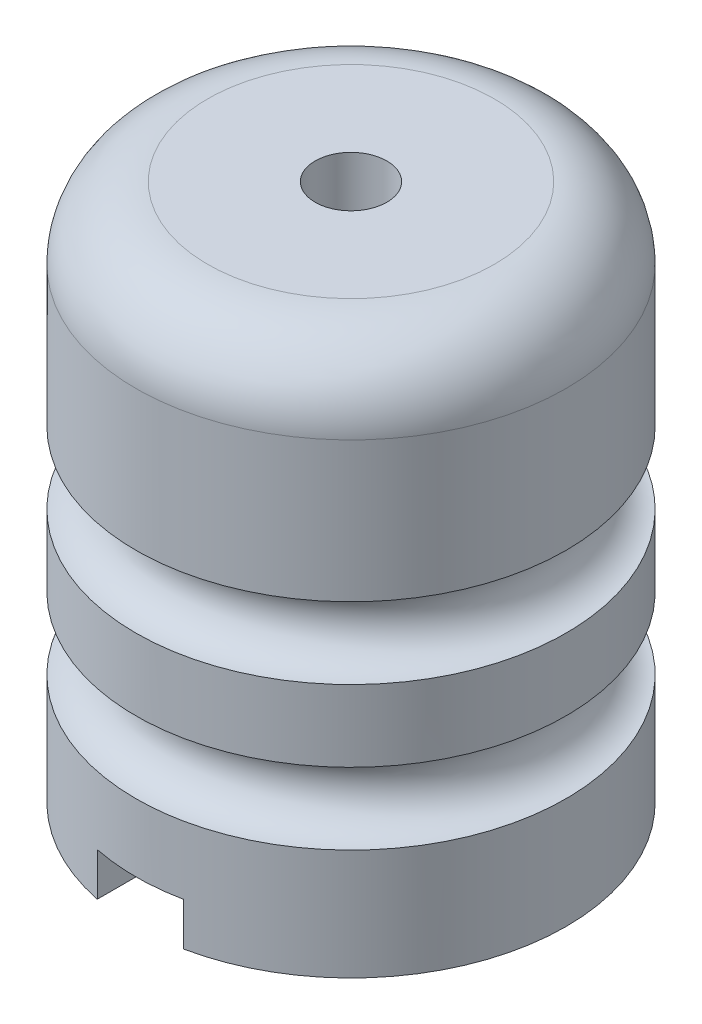
ISO-10303-21;
HEADER;
FILE_DESCRIPTION(('STEP AP214'),'2;1');
FILE_NAME('part.step','',(''),(''),'','','');
FILE_SCHEMA(('AUTOMOTIVE_DESIGN { 1 0 10303 214 1 1 1 1 }'));
ENDSEC;
DATA;
#1=APPLICATION_CONTEXT('core data for automotive mechanical design processes');
#2=APPLICATION_PROTOCOL_DEFINITION('international standard','automotive_design',2000,#1);
#3=PRODUCT_CONTEXT('',#1,'mechanical');
#4=PRODUCT('Part','Part','',(#3));
#5=PRODUCT_RELATED_PRODUCT_CATEGORY('part','',(#4));
#6=PRODUCT_DEFINITION_FORMATION('','',#4);
#7=PRODUCT_DEFINITION_CONTEXT('part definition',#1,'design');
#8=PRODUCT_DEFINITION('design','',#6,#7);
#9=PRODUCT_DEFINITION_SHAPE('','',#8);
#10=(LENGTH_UNIT() NAMED_UNIT(*) SI_UNIT(.MILLI.,.METRE.));
#11=(NAMED_UNIT(*) PLANE_ANGLE_UNIT() SI_UNIT($,.RADIAN.));
#12=(NAMED_UNIT(*) SI_UNIT($,.STERADIAN.) SOLID_ANGLE_UNIT());
#13=UNCERTAINTY_MEASURE_WITH_UNIT(LENGTH_MEASURE(1.E-05),#10,'distance_accuracy_value','');
#14=(GEOMETRIC_REPRESENTATION_CONTEXT(3) GLOBAL_UNCERTAINTY_ASSIGNED_CONTEXT((#13)) GLOBAL_UNIT_ASSIGNED_CONTEXT((#10,
#11,#12)) REPRESENTATION_CONTEXT('',''));
#15=CARTESIAN_POINT('',(0.,0.,0.));
#16=DIRECTION('',(0.,0.,1.));
#17=DIRECTION('',(1.,0.,0.));
#18=AXIS2_PLACEMENT_3D('',#15,#16,#17);
#19=CARTESIAN_POINT('',(30.,-40.4504233490632,0.));
#20=DIRECTION('',(0.,-1.,0.));
#21=DIRECTION('',(1.,0.,0.));
#22=AXIS2_PLACEMENT_3D('',#19,#20,#21);
#23=PLANE('',#22);
#24=DIRECTION('',(0.,0.,1.));
#25=VECTOR('',#24,1.);
#26=CARTESIAN_POINT('',(-5.99999999999999,-40.4504233490632,-35.));
#27=LINE('',#26,#25);
#28=CARTESIAN_POINT('',(-5.99999999999999,-40.4504233490632,21.438132434203));
#29=VERTEX_POINT('',#28);
#30=CARTESIAN_POINT('',(-5.99999999999999,-40.4504233490632,29.3938769133981));
#31=VERTEX_POINT('',#30);
#32=EDGE_CURVE('E118',#29,#31,#27,.T.);
#33=ORIENTED_EDGE('',*,*,#32,.T.);
#34=CARTESIAN_POINT('',(0.,-40.4504233490632,0.));
#35=DIRECTION('',(0.,-1.,0.));
#36=DIRECTION('',(1.,0.,0.));
#37=AXIS2_PLACEMENT_3D('',#34,#35,#36);
#38=CIRCLE('',#37,30.);
#39=CARTESIAN_POINT('',(-5.99999999999999,-40.4504233490632,-29.3938769133981));
#40=VERTEX_POINT('',#39);
#41=EDGE_CURVE('E126',#31,#40,#38,.T.);
#42=ORIENTED_EDGE('',*,*,#41,.T.);
#43=CARTESIAN_POINT('',(-5.99999999999999,-40.4504233490632,-21.438132434203));
#44=VERTEX_POINT('',#43);
#45=EDGE_CURVE('E104',#40,#44,#27,.T.);
#46=ORIENTED_EDGE('',*,*,#45,.T.);
#47=CARTESIAN_POINT('',(0.,-40.4504233490632,0.));
#48=DIRECTION('',(0.,-1.,0.));
#49=DIRECTION('',(1.,0.,0.));
#50=AXIS2_PLACEMENT_3D('',#47,#48,#49);
#51=CIRCLE('',#50,22.2619298863874);
#52=EDGE_CURVE('E219',#29,#44,#51,.T.);
#53=ORIENTED_EDGE('',*,*,#52,.F.);
#54=EDGE_LOOP('',(#33,#42,#46,#53));
#55=FACE_BOUND('',#54,.T.);
#56=ADVANCED_FACE('F39',(#55),#23,.T.);
#57=CARTESIAN_POINT('',(0.,-40.4504233490632,0.));
#58=DIRECTION('',(0.,1.,0.));
#59=DIRECTION('',(-1.,0.,0.));
#60=AXIS2_PLACEMENT_3D('',#57,#58,#59);
#61=CYLINDRICAL_SURFACE('',#60,5.);
#62=CARTESIAN_POINT('',(0.,34.5495766509368,0.));
#63=DIRECTION('',(0.,1.,0.));
#64=DIRECTION('',(-1.,0.,0.));
#65=AXIS2_PLACEMENT_3D('',#62,#63,#64);
#66=CIRCLE('',#65,5.);
#67=CARTESIAN_POINT('',(-5.,34.5495766509368,0.));
#68=VERTEX_POINT('',#67);
#69=EDGE_CURVE('E153',#68,#68,#66,.T.);
#70=ORIENTED_EDGE('',*,*,#69,.T.);
#71=EDGE_LOOP('',(#70));
#72=FACE_BOUND('',#71,.T.);
#73=CARTESIAN_POINT('',(0.,-20.4504233490632,0.));
#74=DIRECTION('',(0.,-1.,0.));
#75=DIRECTION('',(1.,0.,0.));
#76=AXIS2_PLACEMENT_3D('',#73,#74,#75);
#77=CIRCLE('',#76,5.);
#78=CARTESIAN_POINT('',(5.,-20.4504233490632,0.));
#79=VERTEX_POINT('',#78);
#80=EDGE_CURVE('E165',#79,#79,#77,.F.);
#81=ORIENTED_EDGE('',*,*,#80,.F.);
#82=EDGE_LOOP('',(#81));
#83=FACE_BOUND('',#82,.T.);
#84=ADVANCED_FACE('F225',(#72,#83),#61,.F.);
#85=CARTESIAN_POINT('',(0.,24.5495766509368,0.));
#86=DIRECTION('',(0.,-1.,0.));
#87=DIRECTION('',(1.,0.,0.));
#88=AXIS2_PLACEMENT_3D('',#85,#86,#87);
#89=TOROIDAL_SURFACE('',#88,20.,10.);
#90=CARTESIAN_POINT('',(0.,34.5495766509368,0.));
#91=DIRECTION('',(0.,-1.,0.));
#92=DIRECTION('',(1.,0.,0.));
#93=AXIS2_PLACEMENT_3D('',#90,#91,#92);
#94=CIRCLE('',#93,20.);
#95=CARTESIAN_POINT('',(20.,34.5495766509368,0.));
#96=VERTEX_POINT('',#95);
#97=EDGE_CURVE('E135',#96,#96,#94,.T.);
#98=ORIENTED_EDGE('',*,*,#97,.T.);
#99=EDGE_LOOP('',(#98));
#100=FACE_BOUND('',#99,.T.);
#101=CARTESIAN_POINT('',(0.,24.5495766509368,0.));
#102=DIRECTION('',(0.,-1.,0.));
#103=DIRECTION('',(1.,0.,0.));
#104=AXIS2_PLACEMENT_3D('',#101,#102,#103);
#105=CIRCLE('',#104,30.);
#106=CARTESIAN_POINT('',(30.,24.5495766509368,0.));
#107=VERTEX_POINT('',#106);
#108=EDGE_CURVE('E144',#107,#107,#105,.T.);
#109=ORIENTED_EDGE('',*,*,#108,.F.);
#110=EDGE_LOOP('',(#109));
#111=FACE_BOUND('',#110,.T.);
#112=ADVANCED_FACE('F41',(#100,#111),#89,.T.);
#113=CARTESIAN_POINT('',(0.,34.5495766509368,0.));
#114=DIRECTION('',(0.,1.,0.));
#115=DIRECTION('',(-1.,0.,0.));
#116=AXIS2_PLACEMENT_3D('',#113,#114,#115);
#117=PLANE('',#116);
#118=ORIENTED_EDGE('',*,*,#69,.F.);
#119=EDGE_LOOP('',(#118));
#120=FACE_BOUND('',#119,.T.);
#121=ORIENTED_EDGE('',*,*,#97,.F.);
#122=EDGE_LOOP('',(#121));
#123=FACE_BOUND('',#122,.T.);
#124=ADVANCED_FACE('F228',(#120,#123),#117,.T.);
#125=CARTESIAN_POINT('',(0.,-40.4504233490632,0.));
#126=DIRECTION('',(0.,-1.,0.));
#127=DIRECTION('',(1.,0.,0.));
#128=AXIS2_PLACEMENT_3D('',#125,#126,#127);
#129=CYLINDRICAL_SURFACE('',#128,30.);
#130=CARTESIAN_POINT('',(0.,5.,0.));
#131=DIRECTION('',(0.,-1.,0.));
#132=DIRECTION('',(0.,0.,-1.));
#133=AXIS2_PLACEMENT_3D('',#130,#131,#132);
#134=CIRCLE('',#133,30.);
#135=CARTESIAN_POINT('',(0.,5.,-30.));
#136=VERTEX_POINT('',#135);
#137=EDGE_CURVE('E157',#136,#136,#134,.T.);
#138=ORIENTED_EDGE('',*,*,#137,.F.);
#139=EDGE_LOOP('',(#138));
#140=FACE_BOUND('',#139,.T.);
#141=ORIENTED_EDGE('',*,*,#108,.T.);
#142=EDGE_LOOP('',(#141));
#143=FACE_BOUND('',#142,.T.);
#144=ADVANCED_FACE('F231',(#140,#143),#129,.T.);
#145=CARTESIAN_POINT('',(0.,0.,0.));
#146=DIRECTION('',(0.,-1.,0.));
#147=DIRECTION('',(0.,0.,-1.));
#148=AXIS2_PLACEMENT_3D('',#145,#146,#147);
#149=TOROIDAL_SURFACE('',#148,30.,5.);
#150=CARTESIAN_POINT('',(0.,-5.,0.));
#151=DIRECTION('',(0.,1.,0.));
#152=DIRECTION('',(0.,0.,1.));
#153=AXIS2_PLACEMENT_3D('',#150,#151,#152);
#154=CIRCLE('',#153,30.);
#155=CARTESIAN_POINT('',(0.,-5.,30.));
#156=VERTEX_POINT('',#155);
#157=EDGE_CURVE('E161',#156,#156,#154,.T.);
#158=ORIENTED_EDGE('',*,*,#157,.T.);
#159=EDGE_LOOP('',(#158));
#160=FACE_BOUND('',#159,.T.);
#161=ORIENTED_EDGE('',*,*,#137,.T.);
#162=EDGE_LOOP('',(#161));
#163=FACE_BOUND('',#162,.T.);
#164=ADVANCED_FACE('F241',(#160,#163),#149,.F.);
#165=ORIENTED_EDGE('',*,*,#157,.F.);
#166=EDGE_LOOP('',(#165));
#167=FACE_BOUND('',#166,.T.);
#168=CARTESIAN_POINT('',(0.,-15.,0.));
#169=DIRECTION('',(0.,-1.,0.));
#170=DIRECTION('',(0.,0.,-1.));
#171=AXIS2_PLACEMENT_3D('',#168,#169,#170);
#172=CIRCLE('',#171,30.);
#173=CARTESIAN_POINT('',(0.,-15.,-30.));
#174=VERTEX_POINT('',#173);
#175=EDGE_CURVE('E148',#174,#174,#172,.T.);
#176=ORIENTED_EDGE('',*,*,#175,.F.);
#177=EDGE_LOOP('',(#176));
#178=FACE_BOUND('',#177,.T.);
#179=ADVANCED_FACE('F244',(#167,#178),#129,.T.);
#180=CARTESIAN_POINT('',(0.,-20.,0.));
#181=DIRECTION('',(0.,-1.,0.));
#182=DIRECTION('',(0.,0.,-1.));
#183=AXIS2_PLACEMENT_3D('',#180,#181,#182);
#184=TOROIDAL_SURFACE('',#183,30.,5.);
#185=CARTESIAN_POINT('',(0.,-25.,0.));
#186=DIRECTION('',(0.,1.,0.));
#187=DIRECTION('',(0.,0.,1.));
#188=AXIS2_PLACEMENT_3D('',#185,#186,#187);
#189=CIRCLE('',#188,30.);
#190=CARTESIAN_POINT('',(0.,-25.,30.));
#191=VERTEX_POINT('',#190);
#192=EDGE_CURVE('E152',#191,#191,#189,.T.);
#193=ORIENTED_EDGE('',*,*,#192,.T.);
#194=EDGE_LOOP('',(#193));
#195=FACE_BOUND('',#194,.T.);
#196=ORIENTED_EDGE('',*,*,#175,.T.);
#197=EDGE_LOOP('',(#196));
#198=FACE_BOUND('',#197,.T.);
#199=ADVANCED_FACE('F254',(#195,#198),#184,.F.);
#200=DIRECTION('',(0.,0.,1.));
#201=VECTOR('',#200,1.);
#202=CARTESIAN_POINT('',(6.00000000000001,-40.4504233490632,-35.));
#203=LINE('',#202,#201);
#204=CARTESIAN_POINT('',(6.00000000000001,-40.4504233490632,-29.3938769133981));
#205=VERTEX_POINT('',#204);
#206=CARTESIAN_POINT('',(6.00000000000001,-40.4504233490632,-21.438132434203));
#207=VERTEX_POINT('',#206);
#208=EDGE_CURVE('E63',#205,#207,#203,.T.);
#209=ORIENTED_EDGE('',*,*,#208,.F.);
#210=CARTESIAN_POINT('',(6.00000000000001,-40.4504233490632,29.3938769133981));
#211=VERTEX_POINT('',#210);
#212=EDGE_CURVE('E136',#205,#211,#38,.T.);
#213=ORIENTED_EDGE('',*,*,#212,.T.);
#214=CARTESIAN_POINT('',(6.00000000000001,-40.4504233490632,21.438132434203));
#215=VERTEX_POINT('',#214);
#216=EDGE_CURVE('E117',#215,#211,#203,.T.);
#217=ORIENTED_EDGE('',*,*,#216,.F.);
#218=EDGE_CURVE('E130',#207,#215,#51,.T.);
#219=ORIENTED_EDGE('',*,*,#218,.F.);
#220=EDGE_LOOP('',(#209,#213,#217,#219));
#221=FACE_BOUND('',#220,.T.);
#222=ADVANCED_FACE('F258',(#221),#23,.T.);
#223=DIRECTION('',(0.,-1.,0.));
#224=VECTOR('',#223,1.);
#225=CARTESIAN_POINT('',(-5.99999999999999,-40.4504233490632,29.3938769133981));
#226=LINE('',#225,#224);
#227=CARTESIAN_POINT('',(-5.99999999999999,-34.4504233490632,29.3938769133981));
#228=VERTEX_POINT('',#227);
#229=EDGE_CURVE('E131',#228,#31,#226,.T.);
#230=ORIENTED_EDGE('',*,*,#229,.F.);
#231=CARTESIAN_POINT('',(0.,-34.4504233490632,0.));
#232=DIRECTION('',(0.,1.,0.));
#233=DIRECTION('',(0.,0.,1.));
#234=AXIS2_PLACEMENT_3D('',#231,#232,#233);
#235=CIRCLE('',#234,30.);
#236=CARTESIAN_POINT('',(6.00000000000001,-34.4504233490632,29.3938769133981));
#237=VERTEX_POINT('',#236);
#238=EDGE_CURVE('E191',#237,#228,#235,.F.);
#239=ORIENTED_EDGE('',*,*,#238,.F.);
#240=DIRECTION('',(0.,-1.,0.));
#241=VECTOR('',#240,1.);
#242=CARTESIAN_POINT('',(6.00000000000001,-40.4504233490632,29.3938769133981));
#243=LINE('',#242,#241);
#244=EDGE_CURVE('E209',#211,#237,#243,.F.);
#245=ORIENTED_EDGE('',*,*,#244,.F.);
#246=ORIENTED_EDGE('',*,*,#212,.F.);
#247=DIRECTION('',(0.,-1.,0.));
#248=VECTOR('',#247,1.);
#249=CARTESIAN_POINT('',(6.00000000000001,-40.4504233490632,-29.3938769133981));
#250=LINE('',#249,#248);
#251=CARTESIAN_POINT('',(6.00000000000001,-34.4504233490632,-29.3938769133981));
#252=VERTEX_POINT('',#251);
#253=EDGE_CURVE('E199',#252,#205,#250,.T.);
#254=ORIENTED_EDGE('',*,*,#253,.F.);
#255=CARTESIAN_POINT('',(-5.99999999999999,-34.4504233490632,-29.3938769133981));
#256=VERTEX_POINT('',#255);
#257=EDGE_CURVE('E128',#256,#252,#235,.F.);
#258=ORIENTED_EDGE('',*,*,#257,.F.);
#259=DIRECTION('',(0.,-1.,0.));
#260=VECTOR('',#259,1.);
#261=CARTESIAN_POINT('',(-5.99999999999999,-40.4504233490632,-29.3938769133981));
#262=LINE('',#261,#260);
#263=EDGE_CURVE('E108',#40,#256,#262,.F.);
#264=ORIENTED_EDGE('',*,*,#263,.F.);
#265=ORIENTED_EDGE('',*,*,#41,.F.);
#266=EDGE_LOOP('',(#230,#239,#245,#246,#254,#258,#264,#265));
#267=FACE_BOUND('',#266,.T.);
#268=ORIENTED_EDGE('',*,*,#192,.F.);
#269=EDGE_LOOP('',(#268));
#270=FACE_BOUND('',#269,.T.);
#271=ADVANCED_FACE('F124',(#267,#270),#129,.T.);
#272=CARTESIAN_POINT('',(0.,-20.4504233490632,0.));
#273=DIRECTION('',(0.,-1.,0.));
#274=DIRECTION('',(1.,0.,0.));
#275=AXIS2_PLACEMENT_3D('',#272,#273,#274);
#276=PLANE('',#275);
#277=CARTESIAN_POINT('',(0.,-20.4504233490632,0.));
#278=DIRECTION('',(0.,-1.,0.));
#279=DIRECTION('',(1.,0.,0.));
#280=AXIS2_PLACEMENT_3D('',#277,#278,#279);
#281=CIRCLE('',#280,22.2619298863874);
#282=CARTESIAN_POINT('',(22.2619298863874,-20.4504233490632,0.));
#283=VERTEX_POINT('',#282);
#284=EDGE_CURVE('E169',#283,#283,#281,.T.);
#285=ORIENTED_EDGE('',*,*,#284,.T.);
#286=EDGE_LOOP('',(#285));
#287=FACE_BOUND('',#286,.T.);
#288=ORIENTED_EDGE('',*,*,#80,.T.);
#289=EDGE_LOOP('',(#288));
#290=FACE_BOUND('',#289,.T.);
#291=ADVANCED_FACE('F257',(#287,#290),#276,.T.);
#292=CARTESIAN_POINT('',(0.,-20.4504233490632,0.));
#293=DIRECTION('',(0.,-1.,0.));
#294=DIRECTION('',(1.,0.,0.));
#295=AXIS2_PLACEMENT_3D('',#292,#293,#294);
#296=CYLINDRICAL_SURFACE('',#295,22.2619298863874);
#297=ORIENTED_EDGE('',*,*,#284,.F.);
#298=EDGE_LOOP('',(#297));
#299=FACE_BOUND('',#298,.T.);
#300=CARTESIAN_POINT('',(0.,-34.4504233490632,0.));
#301=DIRECTION('',(0.,1.,0.));
#302=DIRECTION('',(0.,0.,1.));
#303=AXIS2_PLACEMENT_3D('',#300,#301,#302);
#304=CIRCLE('',#303,22.2619298863874);
#305=CARTESIAN_POINT('',(6.,-34.4504233490632,21.438132434203));
#306=VERTEX_POINT('',#305);
#307=CARTESIAN_POINT('',(-5.99999999999999,-34.4504233490632,21.438132434203));
#308=VERTEX_POINT('',#307);
#309=EDGE_CURVE('E48',#306,#308,#304,.F.);
#310=ORIENTED_EDGE('',*,*,#309,.T.);
#311=DIRECTION('',(0.,-1.,0.));
#312=VECTOR('',#311,1.);
#313=CARTESIAN_POINT('',(-6.,-20.4504233490632,21.438132434203));
#314=LINE('',#313,#312);
#315=EDGE_CURVE('E11',#308,#29,#314,.T.);
#316=ORIENTED_EDGE('',*,*,#315,.T.);
#317=ORIENTED_EDGE('',*,*,#52,.T.);
#318=DIRECTION('',(0.,-1.,0.));
#319=VECTOR('',#318,1.);
#320=CARTESIAN_POINT('',(-6.,-20.4504233490632,-21.438132434203));
#321=LINE('',#320,#319);
#322=CARTESIAN_POINT('',(-5.99999999999999,-34.4504233490632,-21.438132434203));
#323=VERTEX_POINT('',#322);
#324=EDGE_CURVE('E111',#44,#323,#321,.F.);
#325=ORIENTED_EDGE('',*,*,#324,.T.);
#326=CARTESIAN_POINT('',(6.00000000000001,-34.4504233490632,-21.438132434203));
#327=VERTEX_POINT('',#326);
#328=EDGE_CURVE('E172',#323,#327,#304,.F.);
#329=ORIENTED_EDGE('',*,*,#328,.T.);
#330=DIRECTION('',(0.,-1.,0.));
#331=VECTOR('',#330,1.);
#332=CARTESIAN_POINT('',(6.,-20.4504233490632,-21.438132434203));
#333=LINE('',#332,#331);
#334=EDGE_CURVE('E141',#327,#207,#333,.T.);
#335=ORIENTED_EDGE('',*,*,#334,.T.);
#336=ORIENTED_EDGE('',*,*,#218,.T.);
#337=DIRECTION('',(0.,-1.,0.));
#338=VECTOR('',#337,1.);
#339=CARTESIAN_POINT('',(6.,-20.4504233490632,21.438132434203));
#340=LINE('',#339,#338);
#341=EDGE_CURVE('E177',#215,#306,#340,.F.);
#342=ORIENTED_EDGE('',*,*,#341,.T.);
#343=EDGE_LOOP('',(#310,#316,#317,#325,#329,#335,#336,#342));
#344=FACE_BOUND('',#343,.T.);
#345=ADVANCED_FACE('F184',(#299,#344),#296,.F.);
#346=CARTESIAN_POINT('',(6.00000000000001,-34.4504233490632,-35.));
#347=DIRECTION('',(1.,0.,0.));
#348=DIRECTION('',(0.,1.,0.));
#349=AXIS2_PLACEMENT_3D('',#346,#347,#348);
#350=PLANE('',#349);
#351=ORIENTED_EDGE('',*,*,#253,.T.);
#352=ORIENTED_EDGE('',*,*,#208,.T.);
#353=ORIENTED_EDGE('',*,*,#334,.F.);
#354=DIRECTION('',(0.,0.,1.));
#355=VECTOR('',#354,1.);
#356=CARTESIAN_POINT('',(6.00000000000001,-34.4504233490632,-35.));
#357=LINE('',#356,#355);
#358=EDGE_CURVE('E195',#252,#327,#357,.T.);
#359=ORIENTED_EDGE('',*,*,#358,.F.);
#360=EDGE_LOOP('',(#351,#352,#353,#359));
#361=FACE_BOUND('',#360,.T.);
#362=ADVANCED_FACE('F277',(#361),#350,.F.);
#363=CARTESIAN_POINT('',(-5.99999999999999,-34.4504233490632,-35.));
#364=DIRECTION('',(0.,1.,0.));
#365=DIRECTION('',(0.,0.,1.));
#366=AXIS2_PLACEMENT_3D('',#363,#364,#365);
#367=PLANE('',#366);
#368=ORIENTED_EDGE('',*,*,#257,.T.);
#369=ORIENTED_EDGE('',*,*,#358,.T.);
#370=ORIENTED_EDGE('',*,*,#328,.F.);
#371=DIRECTION('',(0.,0.,1.));
#372=VECTOR('',#371,1.);
#373=CARTESIAN_POINT('',(-5.99999999999999,-34.4504233490632,-35.));
#374=LINE('',#373,#372);
#375=EDGE_CURVE('E194',#256,#323,#374,.T.);
#376=ORIENTED_EDGE('',*,*,#375,.F.);
#377=EDGE_LOOP('',(#368,#369,#370,#376));
#378=FACE_BOUND('',#377,.T.);
#379=ADVANCED_FACE('F279',(#378),#367,.F.);
#380=CARTESIAN_POINT('',(-5.99999999999999,-34.4504233490632,-35.));
#381=DIRECTION('',(-1.,0.,0.));
#382=DIRECTION('',(0.,-1.,0.));
#383=AXIS2_PLACEMENT_3D('',#380,#381,#382);
#384=PLANE('',#383);
#385=ORIENTED_EDGE('',*,*,#263,.T.);
#386=ORIENTED_EDGE('',*,*,#375,.T.);
#387=ORIENTED_EDGE('',*,*,#324,.F.);
#388=ORIENTED_EDGE('',*,*,#45,.F.);
#389=EDGE_LOOP('',(#385,#386,#387,#388));
#390=FACE_BOUND('',#389,.T.);
#391=ADVANCED_FACE('F106',(#390),#384,.F.);
#392=ORIENTED_EDGE('',*,*,#229,.T.);
#393=ORIENTED_EDGE('',*,*,#32,.F.);
#394=ORIENTED_EDGE('',*,*,#315,.F.);
#395=EDGE_CURVE('E190',#308,#228,#374,.T.);
#396=ORIENTED_EDGE('',*,*,#395,.T.);
#397=EDGE_LOOP('',(#392,#393,#394,#396));
#398=FACE_BOUND('',#397,.T.);
#399=ADVANCED_FACE('F288',(#398),#384,.F.);
#400=ORIENTED_EDGE('',*,*,#238,.T.);
#401=ORIENTED_EDGE('',*,*,#395,.F.);
#402=ORIENTED_EDGE('',*,*,#309,.F.);
#403=EDGE_CURVE('E55',#306,#237,#357,.T.);
#404=ORIENTED_EDGE('',*,*,#403,.T.);
#405=EDGE_LOOP('',(#400,#401,#402,#404));
#406=FACE_BOUND('',#405,.T.);
#407=ADVANCED_FACE('F187',(#406),#367,.F.);
#408=ORIENTED_EDGE('',*,*,#244,.T.);
#409=ORIENTED_EDGE('',*,*,#403,.F.);
#410=ORIENTED_EDGE('',*,*,#341,.F.);
#411=ORIENTED_EDGE('',*,*,#216,.T.);
#412=EDGE_LOOP('',(#408,#409,#410,#411));
#413=FACE_BOUND('',#412,.T.);
#414=ADVANCED_FACE('F275',(#413),#350,.F.);
#415=CLOSED_SHELL('',(#56,#84,#112,#124,#144,#164,#179,#199,#222,#271,#291,#345,#362,#379,#391,
#399,#407,#414));
#416=MANIFOLD_SOLID_BREP('B2',#415);
#417=ADVANCED_BREP_SHAPE_REPRESENTATION('',(#18,#416),#14);
#418=SHAPE_DEFINITION_REPRESENTATION(#9,#417);
ENDSEC;
END-ISO-10303-21;
